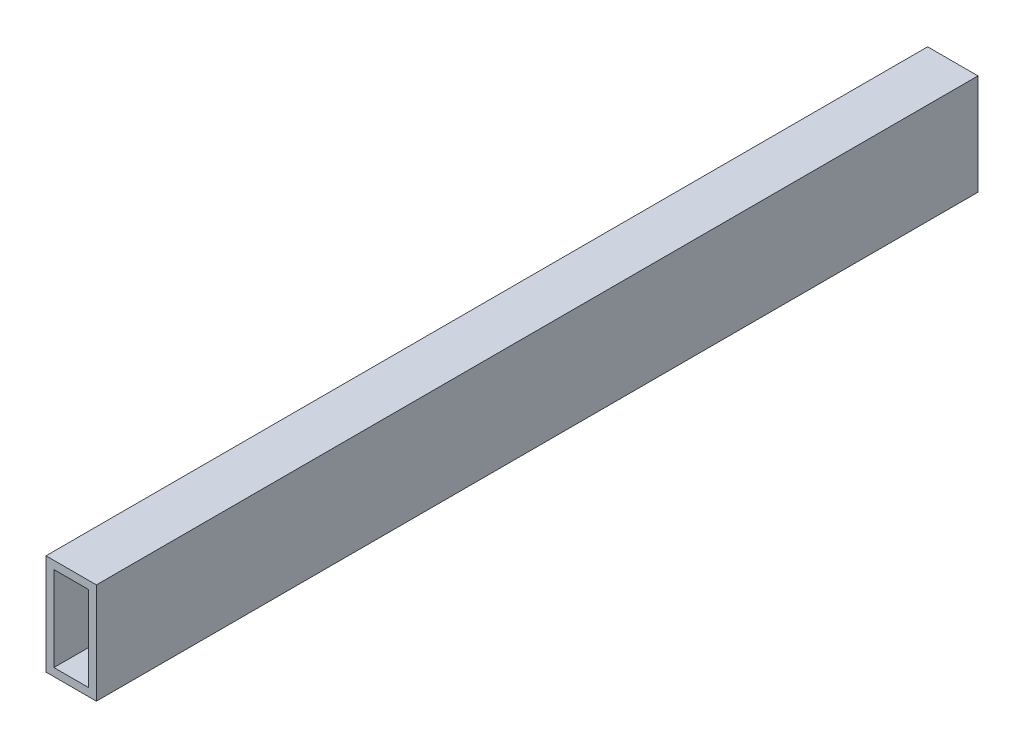
ISO-10303-21;
HEADER;
FILE_DESCRIPTION(('STEP AP214'),'2;1');
FILE_NAME('part.step','',(''),(''),'','','');
FILE_SCHEMA(('AUTOMOTIVE_DESIGN { 1 0 10303 214 1 1 1 1 }'));
ENDSEC;
DATA;
#1=APPLICATION_CONTEXT('core data for automotive mechanical design processes');
#2=APPLICATION_PROTOCOL_DEFINITION('international standard','automotive_design',2000,#1);
#3=PRODUCT_CONTEXT('',#1,'mechanical');
#4=PRODUCT('Part','Part','',(#3));
#5=PRODUCT_RELATED_PRODUCT_CATEGORY('part','',(#4));
#6=PRODUCT_DEFINITION_FORMATION('','',#4);
#7=PRODUCT_DEFINITION_CONTEXT('part definition',#1,'design');
#8=PRODUCT_DEFINITION('design','',#6,#7);
#9=PRODUCT_DEFINITION_SHAPE('','',#8);
#10=(LENGTH_UNIT() NAMED_UNIT(*) SI_UNIT(.MILLI.,.METRE.));
#11=(NAMED_UNIT(*) PLANE_ANGLE_UNIT() SI_UNIT($,.RADIAN.));
#12=(NAMED_UNIT(*) SI_UNIT($,.STERADIAN.) SOLID_ANGLE_UNIT());
#13=UNCERTAINTY_MEASURE_WITH_UNIT(LENGTH_MEASURE(1.E-05),#10,'distance_accuracy_value','');
#14=(GEOMETRIC_REPRESENTATION_CONTEXT(3) GLOBAL_UNCERTAINTY_ASSIGNED_CONTEXT((#13)) GLOBAL_UNIT_ASSIGNED_CONTEXT((#10,
#11,#12)) REPRESENTATION_CONTEXT('',''));
#15=CARTESIAN_POINT('',(0.,0.,0.));
#16=DIRECTION('',(0.,0.,1.));
#17=DIRECTION('',(1.,0.,0.));
#18=AXIS2_PLACEMENT_3D('',#15,#16,#17);
#19=CARTESIAN_POINT('',(-20.,40.,350.));
#20=DIRECTION('',(1.,0.,0.));
#21=DIRECTION('',(0.,0.,-1.));
#22=AXIS2_PLACEMENT_3D('',#19,#20,#21);
#23=PLANE('',#22);
#24=DIRECTION('',(0.,0.,-1.));
#25=VECTOR('',#24,1.);
#26=CARTESIAN_POINT('',(-20.,-40.,350.));
#27=LINE('',#26,#25);
#28=CARTESIAN_POINT('',(-20.,-40.,350.));
#29=VERTEX_POINT('',#28);
#30=CARTESIAN_POINT('',(-20.,-40.,-350.));
#31=VERTEX_POINT('',#30);
#32=EDGE_CURVE('E97',#29,#31,#27,.T.);
#33=ORIENTED_EDGE('',*,*,#32,.F.);
#34=DIRECTION('',(0.,-1.,0.));
#35=VECTOR('',#34,1.);
#36=CARTESIAN_POINT('',(-20.,40.,350.));
#37=LINE('',#36,#35);
#38=CARTESIAN_POINT('',(-20.,40.,350.));
#39=VERTEX_POINT('',#38);
#40=EDGE_CURVE('E86',#39,#29,#37,.T.);
#41=ORIENTED_EDGE('',*,*,#40,.F.);
#42=DIRECTION('',(0.,0.,-1.));
#43=VECTOR('',#42,1.);
#44=CARTESIAN_POINT('',(-20.,40.,350.));
#45=LINE('',#44,#43);
#46=CARTESIAN_POINT('',(-20.,40.,-350.));
#47=VERTEX_POINT('',#46);
#48=EDGE_CURVE('E102',#39,#47,#45,.T.);
#49=ORIENTED_EDGE('',*,*,#48,.T.);
#50=DIRECTION('',(0.,-1.,0.));
#51=VECTOR('',#50,1.);
#52=CARTESIAN_POINT('',(-20.,40.,-350.));
#53=LINE('',#52,#51);
#54=EDGE_CURVE('E98',#47,#31,#53,.T.);
#55=ORIENTED_EDGE('',*,*,#54,.T.);
#56=EDGE_LOOP('',(#33,#41,#49,#55));
#57=FACE_BOUND('',#56,.T.);
#58=ADVANCED_FACE('F34',(#57),#23,.F.);
#59=CARTESIAN_POINT('',(-20.,-40.,350.));
#60=DIRECTION('',(0.,1.,0.));
#61=DIRECTION('',(-1.,0.,0.));
#62=AXIS2_PLACEMENT_3D('',#59,#60,#61);
#63=PLANE('',#62);
#64=DIRECTION('',(0.,0.,-1.));
#65=VECTOR('',#64,1.);
#66=CARTESIAN_POINT('',(20.,-40.,350.));
#67=LINE('',#66,#65);
#68=CARTESIAN_POINT('',(20.,-40.,350.));
#69=VERTEX_POINT('',#68);
#70=CARTESIAN_POINT('',(20.,-40.,-350.));
#71=VERTEX_POINT('',#70);
#72=EDGE_CURVE('E101',#69,#71,#67,.T.);
#73=ORIENTED_EDGE('',*,*,#72,.F.);
#74=DIRECTION('',(1.,0.,0.));
#75=VECTOR('',#74,1.);
#76=CARTESIAN_POINT('',(-20.,-40.,350.));
#77=LINE('',#76,#75);
#78=EDGE_CURVE('E83',#29,#69,#77,.T.);
#79=ORIENTED_EDGE('',*,*,#78,.F.);
#80=ORIENTED_EDGE('',*,*,#32,.T.);
#81=DIRECTION('',(1.,0.,0.));
#82=VECTOR('',#81,1.);
#83=CARTESIAN_POINT('',(-20.,-40.,-350.));
#84=LINE('',#83,#82);
#85=EDGE_CURVE('E124',#31,#71,#84,.T.);
#86=ORIENTED_EDGE('',*,*,#85,.T.);
#87=EDGE_LOOP('',(#73,#79,#80,#86));
#88=FACE_BOUND('',#87,.T.);
#89=ADVANCED_FACE('F104',(#88),#63,.F.);
#90=CARTESIAN_POINT('',(20.,40.,350.));
#91=DIRECTION('',(-1.,0.,0.));
#92=DIRECTION('',(0.,-1.,0.));
#93=AXIS2_PLACEMENT_3D('',#90,#91,#92);
#94=PLANE('',#93);
#95=DIRECTION('',(0.,0.,-1.));
#96=VECTOR('',#95,1.);
#97=CARTESIAN_POINT('',(20.,40.,350.));
#98=LINE('',#97,#96);
#99=CARTESIAN_POINT('',(20.,40.,350.));
#100=VERTEX_POINT('',#99);
#101=CARTESIAN_POINT('',(20.,40.,-350.));
#102=VERTEX_POINT('',#101);
#103=EDGE_CURVE('E38',#100,#102,#98,.T.);
#104=ORIENTED_EDGE('',*,*,#103,.F.);
#105=DIRECTION('',(0.,1.,0.));
#106=VECTOR('',#105,1.);
#107=CARTESIAN_POINT('',(20.,40.,350.));
#108=LINE('',#107,#106);
#109=EDGE_CURVE('E107',#69,#100,#108,.T.);
#110=ORIENTED_EDGE('',*,*,#109,.F.);
#111=ORIENTED_EDGE('',*,*,#72,.T.);
#112=DIRECTION('',(0.,1.,0.));
#113=VECTOR('',#112,1.);
#114=CARTESIAN_POINT('',(20.,40.,-350.));
#115=LINE('',#114,#113);
#116=EDGE_CURVE('E111',#71,#102,#115,.T.);
#117=ORIENTED_EDGE('',*,*,#116,.T.);
#118=EDGE_LOOP('',(#104,#110,#111,#117));
#119=FACE_BOUND('',#118,.T.);
#120=ADVANCED_FACE('F122',(#119),#94,.F.);
#121=CARTESIAN_POINT('',(-20.,40.,350.));
#122=DIRECTION('',(0.,-1.,0.));
#123=DIRECTION('',(1.,0.,0.));
#124=AXIS2_PLACEMENT_3D('',#121,#122,#123);
#125=PLANE('',#124);
#126=DIRECTION('',(-1.,0.,0.));
#127=VECTOR('',#126,1.);
#128=CARTESIAN_POINT('',(-20.,40.,-350.));
#129=LINE('',#128,#127);
#130=EDGE_CURVE('E121',#102,#47,#129,.T.);
#131=ORIENTED_EDGE('',*,*,#130,.T.);
#132=ORIENTED_EDGE('',*,*,#48,.F.);
#133=DIRECTION('',(-1.,0.,0.));
#134=VECTOR('',#133,1.);
#135=CARTESIAN_POINT('',(-20.,40.,350.));
#136=LINE('',#135,#134);
#137=EDGE_CURVE('E90',#100,#39,#136,.T.);
#138=ORIENTED_EDGE('',*,*,#137,.F.);
#139=ORIENTED_EDGE('',*,*,#103,.T.);
#140=EDGE_LOOP('',(#131,#132,#138,#139));
#141=FACE_BOUND('',#140,.T.);
#142=ADVANCED_FACE('F36',(#141),#125,.F.);
#143=CARTESIAN_POINT('',(0.,0.,350.));
#144=DIRECTION('',(0.,0.,1.));
#145=DIRECTION('',(1.,0.,0.));
#146=AXIS2_PLACEMENT_3D('',#143,#144,#145);
#147=PLANE('',#146);
#148=DIRECTION('',(0.,-1.,0.));
#149=VECTOR('',#148,1.);
#150=CARTESIAN_POINT('',(-13.7,33.7,350.));
#151=LINE('',#150,#149);
#152=CARTESIAN_POINT('',(-13.7,-33.7,350.));
#153=VERTEX_POINT('',#152);
#154=CARTESIAN_POINT('',(-13.7,33.7,350.));
#155=VERTEX_POINT('',#154);
#156=EDGE_CURVE('E129',#153,#155,#151,.F.);
#157=ORIENTED_EDGE('',*,*,#156,.T.);
#158=DIRECTION('',(-1.,0.,0.));
#159=VECTOR('',#158,1.);
#160=CARTESIAN_POINT('',(-13.7,33.7,350.));
#161=LINE('',#160,#159);
#162=CARTESIAN_POINT('',(13.7,33.7,350.));
#163=VERTEX_POINT('',#162);
#164=EDGE_CURVE('E125',#155,#163,#161,.F.);
#165=ORIENTED_EDGE('',*,*,#164,.T.);
#166=DIRECTION('',(0.,1.,0.));
#167=VECTOR('',#166,1.);
#168=CARTESIAN_POINT('',(13.7,33.7,350.));
#169=LINE('',#168,#167);
#170=CARTESIAN_POINT('',(13.7,-33.7,350.));
#171=VERTEX_POINT('',#170);
#172=EDGE_CURVE('E143',#163,#171,#169,.F.);
#173=ORIENTED_EDGE('',*,*,#172,.T.);
#174=DIRECTION('',(1.,0.,0.));
#175=VECTOR('',#174,1.);
#176=CARTESIAN_POINT('',(-13.7,-33.7,350.));
#177=LINE('',#176,#175);
#178=EDGE_CURVE('E133',#171,#153,#177,.F.);
#179=ORIENTED_EDGE('',*,*,#178,.T.);
#180=EDGE_LOOP('',(#157,#165,#173,#179));
#181=FACE_BOUND('',#180,.T.);
#182=ORIENTED_EDGE('',*,*,#40,.T.);
#183=ORIENTED_EDGE('',*,*,#78,.T.);
#184=ORIENTED_EDGE('',*,*,#109,.T.);
#185=ORIENTED_EDGE('',*,*,#137,.T.);
#186=EDGE_LOOP('',(#182,#183,#184,#185));
#187=FACE_BOUND('',#186,.T.);
#188=ADVANCED_FACE('F88',(#181,#187),#147,.T.);
#189=CARTESIAN_POINT('',(0.,0.,-350.));
#190=DIRECTION('',(0.,0.,1.));
#191=DIRECTION('',(1.,0.,0.));
#192=AXIS2_PLACEMENT_3D('',#189,#190,#191);
#193=PLANE('',#192);
#194=DIRECTION('',(0.,-1.,0.));
#195=VECTOR('',#194,1.);
#196=CARTESIAN_POINT('',(-13.7,33.7,-350.));
#197=LINE('',#196,#195);
#198=CARTESIAN_POINT('',(-13.7,-33.7,-350.));
#199=VERTEX_POINT('',#198);
#200=CARTESIAN_POINT('',(-13.7,33.7,-350.));
#201=VERTEX_POINT('',#200);
#202=EDGE_CURVE('E11',#199,#201,#197,.F.);
#203=ORIENTED_EDGE('',*,*,#202,.F.);
#204=DIRECTION('',(1.,0.,0.));
#205=VECTOR('',#204,1.);
#206=CARTESIAN_POINT('',(-13.7,-33.7,-350.));
#207=LINE('',#206,#205);
#208=CARTESIAN_POINT('',(13.7,-33.7,-350.));
#209=VERTEX_POINT('',#208);
#210=EDGE_CURVE('E44',#209,#199,#207,.F.);
#211=ORIENTED_EDGE('',*,*,#210,.F.);
#212=DIRECTION('',(0.,1.,0.));
#213=VECTOR('',#212,1.);
#214=CARTESIAN_POINT('',(13.7,33.7,-350.));
#215=LINE('',#214,#213);
#216=CARTESIAN_POINT('',(13.7,33.7,-350.));
#217=VERTEX_POINT('',#216);
#218=EDGE_CURVE('E140',#217,#209,#215,.F.);
#219=ORIENTED_EDGE('',*,*,#218,.F.);
#220=DIRECTION('',(-1.,0.,0.));
#221=VECTOR('',#220,1.);
#222=CARTESIAN_POINT('',(-13.7,33.7,-350.));
#223=LINE('',#222,#221);
#224=EDGE_CURVE('E137',#201,#217,#223,.F.);
#225=ORIENTED_EDGE('',*,*,#224,.F.);
#226=EDGE_LOOP('',(#203,#211,#219,#225));
#227=FACE_BOUND('',#226,.T.);
#228=ORIENTED_EDGE('',*,*,#54,.F.);
#229=ORIENTED_EDGE('',*,*,#130,.F.);
#230=ORIENTED_EDGE('',*,*,#116,.F.);
#231=ORIENTED_EDGE('',*,*,#85,.F.);
#232=EDGE_LOOP('',(#228,#229,#230,#231));
#233=FACE_BOUND('',#232,.T.);
#234=ADVANCED_FACE('F190',(#227,#233),#193,.F.);
#235=CARTESIAN_POINT('',(-13.7,33.7,350.));
#236=DIRECTION('',(0.,1.,0.));
#237=DIRECTION('',(-1.,0.,0.));
#238=AXIS2_PLACEMENT_3D('',#235,#236,#237);
#239=PLANE('',#238);
#240=DIRECTION('',(0.,0.,-1.));
#241=VECTOR('',#240,1.);
#242=CARTESIAN_POINT('',(13.7,33.7,350.));
#243=LINE('',#242,#241);
#244=EDGE_CURVE('E145',#163,#217,#243,.T.);
#245=ORIENTED_EDGE('',*,*,#244,.F.);
#246=ORIENTED_EDGE('',*,*,#164,.F.);
#247=DIRECTION('',(0.,0.,-1.));
#248=VECTOR('',#247,1.);
#249=CARTESIAN_POINT('',(-13.7,33.7,350.));
#250=LINE('',#249,#248);
#251=EDGE_CURVE('E132',#155,#201,#250,.T.);
#252=ORIENTED_EDGE('',*,*,#251,.T.);
#253=ORIENTED_EDGE('',*,*,#224,.T.);
#254=EDGE_LOOP('',(#245,#246,#252,#253));
#255=FACE_BOUND('',#254,.T.);
#256=ADVANCED_FACE('F167',(#255),#239,.F.);
#257=CARTESIAN_POINT('',(13.7,33.7,350.));
#258=DIRECTION('',(1.,0.,0.));
#259=DIRECTION('',(0.,0.,-1.));
#260=AXIS2_PLACEMENT_3D('',#257,#258,#259);
#261=PLANE('',#260);
#262=DIRECTION('',(0.,0.,-1.));
#263=VECTOR('',#262,1.);
#264=CARTESIAN_POINT('',(13.7,-33.7,350.));
#265=LINE('',#264,#263);
#266=EDGE_CURVE('E138',#171,#209,#265,.T.);
#267=ORIENTED_EDGE('',*,*,#266,.F.);
#268=ORIENTED_EDGE('',*,*,#172,.F.);
#269=ORIENTED_EDGE('',*,*,#244,.T.);
#270=ORIENTED_EDGE('',*,*,#218,.T.);
#271=EDGE_LOOP('',(#267,#268,#269,#270));
#272=FACE_BOUND('',#271,.T.);
#273=ADVANCED_FACE('F171',(#272),#261,.F.);
#274=CARTESIAN_POINT('',(-13.7,-33.7,350.));
#275=DIRECTION('',(0.,-1.,0.));
#276=DIRECTION('',(1.,0.,0.));
#277=AXIS2_PLACEMENT_3D('',#274,#275,#276);
#278=PLANE('',#277);
#279=DIRECTION('',(0.,0.,-1.));
#280=VECTOR('',#279,1.);
#281=CARTESIAN_POINT('',(-13.7,-33.7,350.));
#282=LINE('',#281,#280);
#283=EDGE_CURVE('E134',#153,#199,#282,.T.);
#284=ORIENTED_EDGE('',*,*,#283,.F.);
#285=ORIENTED_EDGE('',*,*,#178,.F.);
#286=ORIENTED_EDGE('',*,*,#266,.T.);
#287=ORIENTED_EDGE('',*,*,#210,.T.);
#288=EDGE_LOOP('',(#284,#285,#286,#287));
#289=FACE_BOUND('',#288,.T.);
#290=ADVANCED_FACE('F179',(#289),#278,.F.);
#291=CARTESIAN_POINT('',(-13.7,33.7,350.));
#292=DIRECTION('',(-1.,0.,0.));
#293=DIRECTION('',(0.,0.,1.));
#294=AXIS2_PLACEMENT_3D('',#291,#292,#293);
#295=PLANE('',#294);
#296=ORIENTED_EDGE('',*,*,#202,.T.);
#297=ORIENTED_EDGE('',*,*,#251,.F.);
#298=ORIENTED_EDGE('',*,*,#156,.F.);
#299=ORIENTED_EDGE('',*,*,#283,.T.);
#300=EDGE_LOOP('',(#296,#297,#298,#299));
#301=FACE_BOUND('',#300,.T.);
#302=ADVANCED_FACE('F178',(#301),#295,.F.);
#303=CLOSED_SHELL('',(#58,#89,#120,#142,#188,#234,#256,#273,#290,#302));
#304=MANIFOLD_SOLID_BREP('B2',#303);
#305=ADVANCED_BREP_SHAPE_REPRESENTATION('',(#18,#304),#14);
#306=SHAPE_DEFINITION_REPRESENTATION(#9,#305);
ENDSEC;
END-ISO-10303-21;
